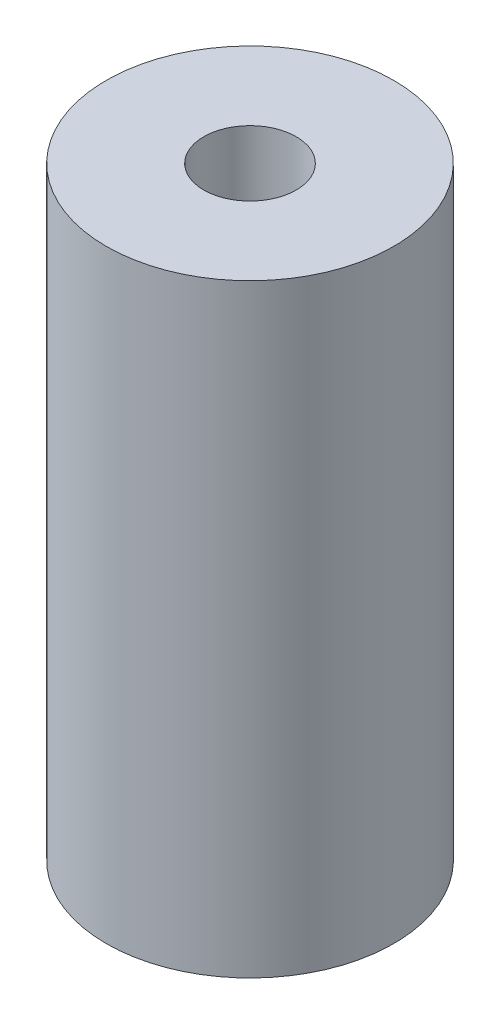
ISO-10303-21;
HEADER;
FILE_DESCRIPTION(('STEP AP214'),'2;1');
FILE_NAME('part.step','',(''),(''),'','','');
FILE_SCHEMA(('AUTOMOTIVE_DESIGN { 1 0 10303 214 1 1 1 1 }'));
ENDSEC;
DATA;
#1=APPLICATION_CONTEXT('core data for automotive mechanical design processes');
#2=APPLICATION_PROTOCOL_DEFINITION('international standard','automotive_design',2000,#1);
#3=PRODUCT_CONTEXT('',#1,'mechanical');
#4=PRODUCT('Part','Part','',(#3));
#5=PRODUCT_RELATED_PRODUCT_CATEGORY('part','',(#4));
#6=PRODUCT_DEFINITION_FORMATION('','',#4);
#7=PRODUCT_DEFINITION_CONTEXT('part definition',#1,'design');
#8=PRODUCT_DEFINITION('design','',#6,#7);
#9=PRODUCT_DEFINITION_SHAPE('','',#8);
#10=(LENGTH_UNIT() NAMED_UNIT(*) SI_UNIT(.MILLI.,.METRE.));
#11=(NAMED_UNIT(*) PLANE_ANGLE_UNIT() SI_UNIT($,.RADIAN.));
#12=(NAMED_UNIT(*) SI_UNIT($,.STERADIAN.) SOLID_ANGLE_UNIT());
#13=UNCERTAINTY_MEASURE_WITH_UNIT(LENGTH_MEASURE(1.E-05),#10,'distance_accuracy_value','');
#14=(GEOMETRIC_REPRESENTATION_CONTEXT(3) GLOBAL_UNCERTAINTY_ASSIGNED_CONTEXT((#13)) GLOBAL_UNIT_ASSIGNED_CONTEXT((#10,
#11,#12)) REPRESENTATION_CONTEXT('',''));
#15=CARTESIAN_POINT('',(0.,0.,0.));
#16=DIRECTION('',(0.,0.,1.));
#17=DIRECTION('',(1.,0.,0.));
#18=AXIS2_PLACEMENT_3D('',#15,#16,#17);
#19=CARTESIAN_POINT('',(0.,-1.666875,0.));
#20=DIRECTION('',(0.,1.,0.));
#21=DIRECTION('',(0.,0.,1.));
#22=AXIS2_PLACEMENT_3D('',#19,#20,#21);
#23=CYLINDRICAL_SURFACE('',#22,2.5527);
#24=CARTESIAN_POINT('',(0.,0.,0.));
#25=DIRECTION('',(0.,1.,0.));
#26=DIRECTION('',(0.,0.,1.));
#27=AXIS2_PLACEMENT_3D('',#24,#25,#26);
#28=CIRCLE('',#27,2.5527);
#29=CARTESIAN_POINT('',(0.,0.,2.5527));
#30=VERTEX_POINT('',#29);
#31=EDGE_CURVE('P0_E27',#30,#30,#28,.F.);
#32=ORIENTED_EDGE('',*,*,#31,.T.);
#33=EDGE_LOOP('',(#32));
#34=FACE_BOUND('',#33,.T.);
#35=CARTESIAN_POINT('',(0.,33.3375,0.));
#36=DIRECTION('',(0.,1.,0.));
#37=DIRECTION('',(0.,0.,1.));
#38=AXIS2_PLACEMENT_3D('',#35,#36,#37);
#39=CIRCLE('',#38,2.5527);
#40=CARTESIAN_POINT('',(0.,33.3375,2.5527));
#41=VERTEX_POINT('',#40);
#42=EDGE_CURVE('P0_E18',#41,#41,#39,.F.);
#43=ORIENTED_EDGE('',*,*,#42,.F.);
#44=EDGE_LOOP('',(#43));
#45=FACE_BOUND('',#44,.T.);
#46=ADVANCED_FACE('P0_F15',(#34,#45),#23,.F.);
#47=CARTESIAN_POINT('',(0.,33.3375,0.));
#48=DIRECTION('',(0.,1.,0.));
#49=DIRECTION('',(0.,0.,1.));
#50=AXIS2_PLACEMENT_3D('',#47,#48,#49);
#51=PLANE('',#50);
#52=ORIENTED_EDGE('',*,*,#42,.T.);
#53=EDGE_LOOP('',(#52));
#54=FACE_BOUND('',#53,.T.);
#55=CARTESIAN_POINT('',(0.,33.3375,0.));
#56=DIRECTION('',(0.,1.,0.));
#57=DIRECTION('',(0.,0.,1.));
#58=AXIS2_PLACEMENT_3D('',#55,#56,#57);
#59=CIRCLE('',#58,7.9375);
#60=CARTESIAN_POINT('',(0.,33.3375,7.9375));
#61=VERTEX_POINT('',#60);
#62=EDGE_CURVE('P0_E22',#61,#61,#59,.F.);
#63=ORIENTED_EDGE('',*,*,#62,.F.);
#64=EDGE_LOOP('',(#63));
#65=FACE_BOUND('',#64,.T.);
#66=ADVANCED_FACE('P0_F35',(#54,#65),#51,.T.);
#67=CARTESIAN_POINT('',(0.,0.,0.));
#68=DIRECTION('',(0.,1.,0.));
#69=DIRECTION('',(0.,0.,1.));
#70=AXIS2_PLACEMENT_3D('',#67,#68,#69);
#71=PLANE('',#70);
#72=ORIENTED_EDGE('',*,*,#31,.F.);
#73=EDGE_LOOP('',(#72));
#74=FACE_BOUND('',#73,.T.);
#75=CARTESIAN_POINT('',(0.,0.,0.));
#76=DIRECTION('',(0.,1.,0.));
#77=DIRECTION('',(0.,0.,1.));
#78=AXIS2_PLACEMENT_3D('',#75,#76,#77);
#79=CIRCLE('',#78,7.9375);
#80=CARTESIAN_POINT('',(0.,0.,7.9375));
#81=VERTEX_POINT('',#80);
#82=EDGE_CURVE('P0_E10',#81,#81,#79,.T.);
#83=ORIENTED_EDGE('',*,*,#82,.F.);
#84=EDGE_LOOP('',(#83));
#85=FACE_BOUND('',#84,.T.);
#86=ADVANCED_FACE('P0_F43',(#74,#85),#71,.F.);
#87=CARTESIAN_POINT('',(0.,0.,0.));
#88=DIRECTION('',(0.,1.,0.));
#89=DIRECTION('',(0.,0.,1.));
#90=AXIS2_PLACEMENT_3D('',#87,#88,#89);
#91=CYLINDRICAL_SURFACE('',#90,7.9375);
#92=ORIENTED_EDGE('',*,*,#62,.T.);
#93=EDGE_LOOP('',(#92));
#94=FACE_BOUND('',#93,.T.);
#95=ORIENTED_EDGE('',*,*,#82,.T.);
#96=EDGE_LOOP('',(#95));
#97=FACE_BOUND('',#96,.T.);
#98=ADVANCED_FACE('P0_F44',(#94,#97),#91,.T.);
#99=CLOSED_SHELL('',(#46,#66,#86,#98));
#100=MANIFOLD_SOLID_BREP('P0_B1',#99);
#101=CARTESIAN_POINT('',(0.,-1.666875,0.));
#102=DIRECTION('',(0.,1.,0.));
#103=DIRECTION('',(0.,0.,1.));
#104=AXIS2_PLACEMENT_3D('',#101,#102,#103);
#105=CYLINDRICAL_SURFACE('',#104,3.175);
#106=CARTESIAN_POINT('',(0.,7.9375,0.));
#107=DIRECTION('',(0.,1.,0.));
#108=DIRECTION('',(0.,0.,1.));
#109=AXIS2_PLACEMENT_3D('',#106,#107,#108);
#110=CIRCLE('',#109,3.175);
#111=CARTESIAN_POINT('',(0.,7.9375,3.175));
#112=VERTEX_POINT('',#111);
#113=EDGE_CURVE('P1_E11',#112,#112,#110,.T.);
#114=ORIENTED_EDGE('',*,*,#113,.T.);
#115=EDGE_LOOP('',(#114));
#116=FACE_BOUND('',#115,.T.);
#117=CARTESIAN_POINT('',(0.,33.3375,0.));
#118=DIRECTION('',(0.,1.,0.));
#119=DIRECTION('',(0.,0.,1.));
#120=AXIS2_PLACEMENT_3D('',#117,#118,#119);
#121=CIRCLE('',#120,3.175);
#122=CARTESIAN_POINT('',(0.,33.3375,3.175));
#123=VERTEX_POINT('',#122);
#124=EDGE_CURVE('P1_E24',#123,#123,#121,.F.);
#125=ORIENTED_EDGE('',*,*,#124,.T.);
#126=EDGE_LOOP('',(#125));
#127=FACE_BOUND('',#126,.T.);
#128=ADVANCED_FACE('P1_F17',(#116,#127),#105,.T.);
#129=CARTESIAN_POINT('',(0.,7.9375,0.));
#130=DIRECTION('',(0.,1.,0.));
#131=DIRECTION('',(0.,0.,1.));
#132=AXIS2_PLACEMENT_3D('',#129,#130,#131);
#133=PLANE('',#132);
#134=CARTESIAN_POINT('',(2.5527,7.9375,0.));
#135=CARTESIAN_POINT('',(2.5527,7.9375,0.48664342702378));
#136=CARTESIAN_POINT('',(2.37347059612207,7.9375,0.939635365098593));
#137=CARTESIAN_POINT('',(2.17915938203478,7.9375,1.43074570500141));
#138=CARTESIAN_POINT('',(1.8050314803349,7.9375,1.8050314803349));
#139=CARTESIAN_POINT('',(1.43164861172287,7.9375,2.1785719081932));
#140=CARTESIAN_POINT('',(0.939635365098593,7.9375,2.37347059612207));
#141=CARTESIAN_POINT('',(0.48743420632565,7.9375,2.55259872555648));
#142=CARTESIAN_POINT('',(0.,7.9375,2.5527));
#143=CARTESIAN_POINT('',(-0.486388011119456,7.9375,2.55280105707503));
#144=CARTESIAN_POINT('',(-0.939635365098593,7.9375,2.37347059612207));
#145=CARTESIAN_POINT('',(-1.43074570500176,7.9375,2.17915938203464));
#146=CARTESIAN_POINT('',(-1.8050314803349,7.9375,1.8050314803349));
#147=CARTESIAN_POINT('',(-2.17857190819384,7.9375,1.43164861172201));
#148=CARTESIAN_POINT('',(-2.37347059612207,7.9375,0.939635365098593));
#149=CARTESIAN_POINT('',(-2.5527,7.9375,0.487178543404457));
#150=CARTESIAN_POINT('',(-2.5527,7.9375,0.));
#151=B_SPLINE_CURVE_WITH_KNOTS('',2,(#134,#135,#136,#137,#138,#139,#140,#141,#142,#143,#144,
#145,#146,#147,#148,#149,#150),.UNSPECIFIED.,.F.,.F.,(3,2,2,2,2,2,2,2,3),(0.,0.125,0.25,0.375,
0.5,0.625,0.75,0.875,1.),.UNSPECIFIED.);
#152=CARTESIAN_POINT('',(2.5527,7.9375,0.));
#153=VERTEX_POINT('',#152);
#154=CARTESIAN_POINT('',(-2.5527,7.9375,0.));
#155=VERTEX_POINT('',#154);
#156=EDGE_CURVE('P1_E28',#153,#155,#151,.T.);
#157=ORIENTED_EDGE('',*,*,#156,.F.);
#158=CARTESIAN_POINT('',(-2.5527,7.9375,0.));
#159=CARTESIAN_POINT('',(-2.5527,7.9375,-0.48664342702378));
#160=CARTESIAN_POINT('',(-2.37347059612207,7.9375,-0.939635365098593));
#161=CARTESIAN_POINT('',(-2.17915938203478,7.9375,-1.43074570500141));
#162=CARTESIAN_POINT('',(-1.8050314803349,7.9375,-1.8050314803349));
#163=CARTESIAN_POINT('',(-1.43164861172287,7.9375,-2.1785719081932));
#164=CARTESIAN_POINT('',(-0.939635365098593,7.9375,-2.37347059612207));
#165=CARTESIAN_POINT('',(-0.48743420632565,7.9375,-2.55259872555648));
#166=CARTESIAN_POINT('',(0.,7.9375,-2.5527));
#167=CARTESIAN_POINT('',(0.486388011119456,7.9375,-2.55280105707503));
#168=CARTESIAN_POINT('',(0.939635365098593,7.9375,-2.37347059612207));
#169=CARTESIAN_POINT('',(1.43074570500176,7.9375,-2.17915938203464));
#170=CARTESIAN_POINT('',(1.8050314803349,7.9375,-1.8050314803349));
#171=CARTESIAN_POINT('',(2.17857190819384,7.9375,-1.43164861172201));
#172=CARTESIAN_POINT('',(2.37347059612207,7.9375,-0.939635365098593));
#173=CARTESIAN_POINT('',(2.5527,7.9375,-0.487178543404457));
#174=CARTESIAN_POINT('',(2.5527,7.9375,0.));
#175=B_SPLINE_CURVE_WITH_KNOTS('',2,(#158,#159,#160,#161,#162,#163,#164,#165,#166,#167,#168,
#169,#170,#171,#172,#173,#174),.UNSPECIFIED.,.F.,.F.,(3,2,2,2,2,2,2,2,3),(0.,0.125,0.25,0.375,
0.5,0.625,0.75,0.875,1.),.UNSPECIFIED.);
#176=EDGE_CURVE('P1_E33',#155,#153,#175,.T.);
#177=ORIENTED_EDGE('',*,*,#176,.F.);
#178=EDGE_LOOP('',(#157,#177));
#179=FACE_BOUND('',#178,.T.);
#180=ORIENTED_EDGE('',*,*,#113,.F.);
#181=EDGE_LOOP('',(#180));
#182=FACE_BOUND('',#181,.T.);
#183=ADVANCED_FACE('P1_F18',(#179,#182),#133,.F.);
#184=OPEN_SHELL('',(#128,#183));
#185=SHELL_BASED_SURFACE_MODEL('P1_B1',(#184));
#186=ADVANCED_BREP_SHAPE_REPRESENTATION('',(#18,#100),#14);
#187=MANIFOLD_SURFACE_SHAPE_REPRESENTATION('',(#18,#185),#14);
#188=SHAPE_REPRESENTATION('',(#18),#14);
#189=SHAPE_DEFINITION_REPRESENTATION(#9,#188);
#190=SHAPE_REPRESENTATION_RELATIONSHIP('','',#188,#186);
#191=SHAPE_REPRESENTATION_RELATIONSHIP('','',#188,#187);
ENDSEC;
END-ISO-10303-21;
